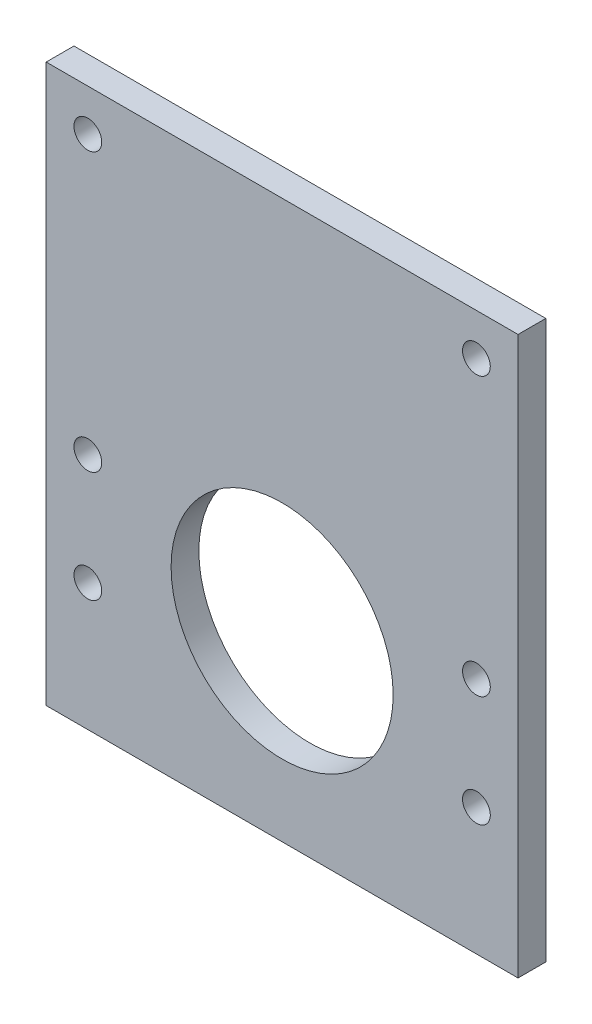
ISO-10303-21;
HEADER;
FILE_DESCRIPTION(('STEP AP214'),'2;1');
FILE_NAME('part.step','',(''),(''),'','','');
FILE_SCHEMA(('AUTOMOTIVE_DESIGN { 1 0 10303 214 1 1 1 1 }'));
ENDSEC;
DATA;
#1=APPLICATION_CONTEXT('core data for automotive mechanical design processes');
#2=APPLICATION_PROTOCOL_DEFINITION('international standard','automotive_design',2000,#1);
#3=PRODUCT_CONTEXT('',#1,'mechanical');
#4=PRODUCT('Part','Part','',(#3));
#5=PRODUCT_RELATED_PRODUCT_CATEGORY('part','',(#4));
#6=PRODUCT_DEFINITION_FORMATION('','',#4);
#7=PRODUCT_DEFINITION_CONTEXT('part definition',#1,'design');
#8=PRODUCT_DEFINITION('design','',#6,#7);
#9=PRODUCT_DEFINITION_SHAPE('','',#8);
#10=(LENGTH_UNIT() NAMED_UNIT(*) SI_UNIT(.MILLI.,.METRE.));
#11=(NAMED_UNIT(*) PLANE_ANGLE_UNIT() SI_UNIT($,.RADIAN.));
#12=(NAMED_UNIT(*) SI_UNIT($,.STERADIAN.) SOLID_ANGLE_UNIT());
#13=UNCERTAINTY_MEASURE_WITH_UNIT(LENGTH_MEASURE(1.E-05),#10,'distance_accuracy_value','');
#14=(GEOMETRIC_REPRESENTATION_CONTEXT(3) GLOBAL_UNCERTAINTY_ASSIGNED_CONTEXT((#13)) GLOBAL_UNIT_ASSIGNED_CONTEXT((#10,
#11,#12)) REPRESENTATION_CONTEXT('',''));
#15=CARTESIAN_POINT('',(0.,0.,0.));
#16=DIRECTION('',(0.,0.,1.));
#17=DIRECTION('',(1.,0.,0.));
#18=AXIS2_PLACEMENT_3D('',#15,#16,#17);
#19=CARTESIAN_POINT('',(0.,0.,6.35));
#20=DIRECTION('',(0.,0.,1.));
#21=DIRECTION('',(1.,0.,0.));
#22=AXIS2_PLACEMENT_3D('',#19,#20,#21);
#23=PLANE('',#22);
#24=CARTESIAN_POINT('',(44.45,-12.7,6.35));
#25=DIRECTION('',(0.,0.,1.));
#26=DIRECTION('',(-1.,0.,0.));
#27=AXIS2_PLACEMENT_3D('',#24,#25,#26);
#28=CIRCLE('',#27,3.175);
#29=CARTESIAN_POINT('',(41.275,-12.7,6.35));
#30=VERTEX_POINT('',#29);
#31=EDGE_CURVE('E140',#30,#30,#28,.T.);
#32=ORIENTED_EDGE('',*,*,#31,.F.);
#33=EDGE_LOOP('',(#32));
#34=FACE_BOUND('',#33,.T.);
#35=CARTESIAN_POINT('',(-44.45,12.7,6.35));
#36=DIRECTION('',(0.,0.,1.));
#37=DIRECTION('',(1.,0.,0.));
#38=AXIS2_PLACEMENT_3D('',#35,#36,#37);
#39=CIRCLE('',#38,3.175);
#40=CARTESIAN_POINT('',(-41.275,12.7,6.35));
#41=VERTEX_POINT('',#40);
#42=EDGE_CURVE('E128',#41,#41,#39,.T.);
#43=ORIENTED_EDGE('',*,*,#42,.F.);
#44=EDGE_LOOP('',(#43));
#45=FACE_BOUND('',#44,.T.);
#46=CARTESIAN_POINT('',(-44.45,76.2,6.35));
#47=DIRECTION('',(0.,0.,1.));
#48=DIRECTION('',(1.,0.,0.));
#49=AXIS2_PLACEMENT_3D('',#46,#47,#48);
#50=CIRCLE('',#49,3.175);
#51=CARTESIAN_POINT('',(-41.275,76.2,6.35));
#52=VERTEX_POINT('',#51);
#53=EDGE_CURVE('E116',#52,#52,#50,.T.);
#54=ORIENTED_EDGE('',*,*,#53,.F.);
#55=EDGE_LOOP('',(#54));
#56=FACE_BOUND('',#55,.T.);
#57=DIRECTION('',(0.,-1.,0.));
#58=VECTOR('',#57,1.);
#59=CARTESIAN_POINT('',(-53.975,85.725,6.35));
#60=LINE('',#59,#58);
#61=CARTESIAN_POINT('',(-53.975,85.725,6.35));
#62=VERTEX_POINT('',#61);
#63=CARTESIAN_POINT('',(-53.975,-41.783,6.35));
#64=VERTEX_POINT('',#63);
#65=EDGE_CURVE('E86',#62,#64,#60,.T.);
#66=ORIENTED_EDGE('',*,*,#65,.T.);
#67=DIRECTION('',(1.,0.,0.));
#68=VECTOR('',#67,1.);
#69=CARTESIAN_POINT('',(-53.975,-41.783,6.35));
#70=LINE('',#69,#68);
#71=CARTESIAN_POINT('',(53.975,-41.783,6.35));
#72=VERTEX_POINT('',#71);
#73=EDGE_CURVE('E81',#64,#72,#70,.T.);
#74=ORIENTED_EDGE('',*,*,#73,.T.);
#75=DIRECTION('',(0.,1.,0.));
#76=VECTOR('',#75,1.);
#77=CARTESIAN_POINT('',(53.975,85.725,6.35));
#78=LINE('',#77,#76);
#79=CARTESIAN_POINT('',(53.975,85.725,6.35));
#80=VERTEX_POINT('',#79);
#81=EDGE_CURVE('E84',#72,#80,#78,.T.);
#82=ORIENTED_EDGE('',*,*,#81,.T.);
#83=DIRECTION('',(-1.,0.,0.));
#84=VECTOR('',#83,1.);
#85=CARTESIAN_POINT('',(-53.975,85.725,6.35));
#86=LINE('',#85,#84);
#87=EDGE_CURVE('E51',#80,#62,#86,.T.);
#88=ORIENTED_EDGE('',*,*,#87,.T.);
#89=EDGE_LOOP('',(#66,#74,#82,#88));
#90=FACE_BOUND('',#89,.T.);
#91=CARTESIAN_POINT('',(0.,0.,6.35));
#92=DIRECTION('',(0.,0.,1.));
#93=DIRECTION('',(1.,0.,0.));
#94=AXIS2_PLACEMENT_3D('',#91,#92,#93);
#95=CIRCLE('',#94,25.4);
#96=CARTESIAN_POINT('',(25.4,0.,6.35));
#97=VERTEX_POINT('',#96);
#98=EDGE_CURVE('E101',#97,#97,#95,.T.);
#99=ORIENTED_EDGE('',*,*,#98,.F.);
#100=EDGE_LOOP('',(#99));
#101=FACE_BOUND('',#100,.T.);
#102=CARTESIAN_POINT('',(44.45,76.2,6.35));
#103=DIRECTION('',(0.,0.,1.));
#104=DIRECTION('',(1.,0.,0.));
#105=AXIS2_PLACEMENT_3D('',#102,#103,#104);
#106=CIRCLE('',#105,3.175);
#107=CARTESIAN_POINT('',(47.625,76.2,6.35));
#108=VERTEX_POINT('',#107);
#109=EDGE_CURVE('E122',#108,#108,#106,.T.);
#110=ORIENTED_EDGE('',*,*,#109,.F.);
#111=EDGE_LOOP('',(#110));
#112=FACE_BOUND('',#111,.T.);
#113=CARTESIAN_POINT('',(-44.45,-12.7,6.35));
#114=DIRECTION('',(0.,0.,1.));
#115=DIRECTION('',(1.,0.,0.));
#116=AXIS2_PLACEMENT_3D('',#113,#114,#115);
#117=CIRCLE('',#116,3.175);
#118=CARTESIAN_POINT('',(-41.275,-12.7,6.35));
#119=VERTEX_POINT('',#118);
#120=EDGE_CURVE('E134',#119,#119,#117,.T.);
#121=ORIENTED_EDGE('',*,*,#120,.F.);
#122=EDGE_LOOP('',(#121));
#123=FACE_BOUND('',#122,.T.);
#124=CARTESIAN_POINT('',(44.45,12.7,6.35));
#125=DIRECTION('',(0.,0.,1.));
#126=DIRECTION('',(-1.,0.,0.));
#127=AXIS2_PLACEMENT_3D('',#124,#125,#126);
#128=CIRCLE('',#127,3.175);
#129=CARTESIAN_POINT('',(41.275,12.7,6.35));
#130=VERTEX_POINT('',#129);
#131=EDGE_CURVE('E146',#130,#130,#128,.T.);
#132=ORIENTED_EDGE('',*,*,#131,.F.);
#133=EDGE_LOOP('',(#132));
#134=FACE_BOUND('',#133,.T.);
#135=ADVANCED_FACE('F34',(#34,#45,#56,#90,#101,#112,#123,#134),#23,.T.);
#136=CARTESIAN_POINT('',(0.,0.,0.));
#137=DIRECTION('',(0.,0.,1.));
#138=DIRECTION('',(1.,0.,0.));
#139=AXIS2_PLACEMENT_3D('',#136,#137,#138);
#140=PLANE('',#139);
#141=DIRECTION('',(0.,-1.,0.));
#142=VECTOR('',#141,1.);
#143=CARTESIAN_POINT('',(-53.975,85.725,0.));
#144=LINE('',#143,#142);
#145=CARTESIAN_POINT('',(-53.975,85.725,0.));
#146=VERTEX_POINT('',#145);
#147=CARTESIAN_POINT('',(-53.975,-41.783,0.));
#148=VERTEX_POINT('',#147);
#149=EDGE_CURVE('E98',#146,#148,#144,.T.);
#150=ORIENTED_EDGE('',*,*,#149,.F.);
#151=DIRECTION('',(-1.,0.,0.));
#152=VECTOR('',#151,1.);
#153=CARTESIAN_POINT('',(-53.975,85.725,0.));
#154=LINE('',#153,#152);
#155=CARTESIAN_POINT('',(53.975,85.725,0.));
#156=VERTEX_POINT('',#155);
#157=EDGE_CURVE('E74',#156,#146,#154,.T.);
#158=ORIENTED_EDGE('',*,*,#157,.F.);
#159=DIRECTION('',(0.,1.,0.));
#160=VECTOR('',#159,1.);
#161=CARTESIAN_POINT('',(53.975,85.725,0.));
#162=LINE('',#161,#160);
#163=CARTESIAN_POINT('',(53.975,-41.783,0.));
#164=VERTEX_POINT('',#163);
#165=EDGE_CURVE('E68',#164,#156,#162,.T.);
#166=ORIENTED_EDGE('',*,*,#165,.F.);
#167=DIRECTION('',(1.,0.,0.));
#168=VECTOR('',#167,1.);
#169=CARTESIAN_POINT('',(-53.975,-41.783,0.));
#170=LINE('',#169,#168);
#171=EDGE_CURVE('E90',#148,#164,#170,.T.);
#172=ORIENTED_EDGE('',*,*,#171,.F.);
#173=EDGE_LOOP('',(#150,#158,#166,#172));
#174=FACE_BOUND('',#173,.T.);
#175=CARTESIAN_POINT('',(0.,0.,0.));
#176=DIRECTION('',(0.,0.,1.));
#177=DIRECTION('',(1.,0.,0.));
#178=AXIS2_PLACEMENT_3D('',#175,#176,#177);
#179=CIRCLE('',#178,25.4);
#180=CARTESIAN_POINT('',(25.4,0.,0.));
#181=VERTEX_POINT('',#180);
#182=EDGE_CURVE('E113',#181,#181,#179,.T.);
#183=ORIENTED_EDGE('',*,*,#182,.T.);
#184=EDGE_LOOP('',(#183));
#185=FACE_BOUND('',#184,.T.);
#186=CARTESIAN_POINT('',(-44.45,76.2,0.));
#187=DIRECTION('',(0.,0.,1.));
#188=DIRECTION('',(1.,0.,0.));
#189=AXIS2_PLACEMENT_3D('',#186,#187,#188);
#190=CIRCLE('',#189,3.175);
#191=CARTESIAN_POINT('',(-41.275,76.2,0.));
#192=VERTEX_POINT('',#191);
#193=EDGE_CURVE('E119',#192,#192,#190,.T.);
#194=ORIENTED_EDGE('',*,*,#193,.T.);
#195=EDGE_LOOP('',(#194));
#196=FACE_BOUND('',#195,.T.);
#197=CARTESIAN_POINT('',(44.45,76.2,0.));
#198=DIRECTION('',(0.,0.,1.));
#199=DIRECTION('',(1.,0.,0.));
#200=AXIS2_PLACEMENT_3D('',#197,#198,#199);
#201=CIRCLE('',#200,3.175);
#202=CARTESIAN_POINT('',(47.625,76.2,0.));
#203=VERTEX_POINT('',#202);
#204=EDGE_CURVE('E125',#203,#203,#201,.T.);
#205=ORIENTED_EDGE('',*,*,#204,.T.);
#206=EDGE_LOOP('',(#205));
#207=FACE_BOUND('',#206,.T.);
#208=CARTESIAN_POINT('',(-44.45,12.7,0.));
#209=DIRECTION('',(0.,0.,1.));
#210=DIRECTION('',(1.,0.,0.));
#211=AXIS2_PLACEMENT_3D('',#208,#209,#210);
#212=CIRCLE('',#211,3.175);
#213=CARTESIAN_POINT('',(-41.275,12.7,0.));
#214=VERTEX_POINT('',#213);
#215=EDGE_CURVE('E131',#214,#214,#212,.T.);
#216=ORIENTED_EDGE('',*,*,#215,.T.);
#217=EDGE_LOOP('',(#216));
#218=FACE_BOUND('',#217,.T.);
#219=CARTESIAN_POINT('',(-44.45,-12.7,0.));
#220=DIRECTION('',(0.,0.,1.));
#221=DIRECTION('',(1.,0.,0.));
#222=AXIS2_PLACEMENT_3D('',#219,#220,#221);
#223=CIRCLE('',#222,3.175);
#224=CARTESIAN_POINT('',(-41.275,-12.7,0.));
#225=VERTEX_POINT('',#224);
#226=EDGE_CURVE('E137',#225,#225,#223,.T.);
#227=ORIENTED_EDGE('',*,*,#226,.T.);
#228=EDGE_LOOP('',(#227));
#229=FACE_BOUND('',#228,.T.);
#230=CARTESIAN_POINT('',(44.45,-12.7,0.));
#231=DIRECTION('',(0.,0.,1.));
#232=DIRECTION('',(-1.,0.,0.));
#233=AXIS2_PLACEMENT_3D('',#230,#231,#232);
#234=CIRCLE('',#233,3.175);
#235=CARTESIAN_POINT('',(41.275,-12.7,0.));
#236=VERTEX_POINT('',#235);
#237=EDGE_CURVE('E143',#236,#236,#234,.T.);
#238=ORIENTED_EDGE('',*,*,#237,.T.);
#239=EDGE_LOOP('',(#238));
#240=FACE_BOUND('',#239,.T.);
#241=CARTESIAN_POINT('',(44.45,12.7,0.));
#242=DIRECTION('',(0.,0.,1.));
#243=DIRECTION('',(-1.,0.,0.));
#244=AXIS2_PLACEMENT_3D('',#241,#242,#243);
#245=CIRCLE('',#244,3.175);
#246=CARTESIAN_POINT('',(41.275,12.7,0.));
#247=VERTEX_POINT('',#246);
#248=EDGE_CURVE('E149',#247,#247,#245,.T.);
#249=ORIENTED_EDGE('',*,*,#248,.T.);
#250=EDGE_LOOP('',(#249));
#251=FACE_BOUND('',#250,.T.);
#252=ADVANCED_FACE('F109',(#174,#185,#196,#207,#218,#229,#240,#251),#140,.F.);
#253=CARTESIAN_POINT('',(-53.975,85.725,6.35));
#254=DIRECTION('',(1.,0.,0.));
#255=DIRECTION('',(0.,1.,0.));
#256=AXIS2_PLACEMENT_3D('',#253,#254,#255);
#257=PLANE('',#256);
#258=ORIENTED_EDGE('',*,*,#149,.T.);
#259=DIRECTION('',(0.,0.,-1.));
#260=VECTOR('',#259,1.);
#261=CARTESIAN_POINT('',(-53.975,-41.783,6.35));
#262=LINE('',#261,#260);
#263=EDGE_CURVE('E11',#64,#148,#262,.T.);
#264=ORIENTED_EDGE('',*,*,#263,.F.);
#265=ORIENTED_EDGE('',*,*,#65,.F.);
#266=DIRECTION('',(0.,0.,-1.));
#267=VECTOR('',#266,1.);
#268=CARTESIAN_POINT('',(-53.975,85.725,6.35));
#269=LINE('',#268,#267);
#270=EDGE_CURVE('E94',#62,#146,#269,.T.);
#271=ORIENTED_EDGE('',*,*,#270,.T.);
#272=EDGE_LOOP('',(#258,#264,#265,#271));
#273=FACE_BOUND('',#272,.T.);
#274=ADVANCED_FACE('F36',(#273),#257,.F.);
#275=CARTESIAN_POINT('',(-53.975,-41.783,6.35));
#276=DIRECTION('',(0.,1.,0.));
#277=DIRECTION('',(0.,0.,1.));
#278=AXIS2_PLACEMENT_3D('',#275,#276,#277);
#279=PLANE('',#278);
#280=ORIENTED_EDGE('',*,*,#171,.T.);
#281=DIRECTION('',(0.,0.,-1.));
#282=VECTOR('',#281,1.);
#283=CARTESIAN_POINT('',(53.975,-41.783,6.35));
#284=LINE('',#283,#282);
#285=EDGE_CURVE('E43',#72,#164,#284,.T.);
#286=ORIENTED_EDGE('',*,*,#285,.F.);
#287=ORIENTED_EDGE('',*,*,#73,.F.);
#288=ORIENTED_EDGE('',*,*,#263,.T.);
#289=EDGE_LOOP('',(#280,#286,#287,#288));
#290=FACE_BOUND('',#289,.T.);
#291=ADVANCED_FACE('F89',(#290),#279,.F.);
#292=CARTESIAN_POINT('',(53.975,85.725,6.35));
#293=DIRECTION('',(-1.,0.,0.));
#294=DIRECTION('',(0.,-1.,0.));
#295=AXIS2_PLACEMENT_3D('',#292,#293,#294);
#296=PLANE('',#295);
#297=ORIENTED_EDGE('',*,*,#165,.T.);
#298=DIRECTION('',(0.,0.,-1.));
#299=VECTOR('',#298,1.);
#300=CARTESIAN_POINT('',(53.975,85.725,6.35));
#301=LINE('',#300,#299);
#302=EDGE_CURVE('E91',#80,#156,#301,.T.);
#303=ORIENTED_EDGE('',*,*,#302,.F.);
#304=ORIENTED_EDGE('',*,*,#81,.F.);
#305=ORIENTED_EDGE('',*,*,#285,.T.);
#306=EDGE_LOOP('',(#297,#303,#304,#305));
#307=FACE_BOUND('',#306,.T.);
#308=ADVANCED_FACE('F92',(#307),#296,.F.);
#309=CARTESIAN_POINT('',(-53.975,85.725,6.35));
#310=DIRECTION('',(0.,-1.,0.));
#311=DIRECTION('',(0.,0.,-1.));
#312=AXIS2_PLACEMENT_3D('',#309,#310,#311);
#313=PLANE('',#312);
#314=ORIENTED_EDGE('',*,*,#157,.T.);
#315=ORIENTED_EDGE('',*,*,#270,.F.);
#316=ORIENTED_EDGE('',*,*,#87,.F.);
#317=ORIENTED_EDGE('',*,*,#302,.T.);
#318=EDGE_LOOP('',(#314,#315,#316,#317));
#319=FACE_BOUND('',#318,.T.);
#320=ADVANCED_FACE('F106',(#319),#313,.F.);
#321=CARTESIAN_POINT('',(0.,0.,6.35));
#322=DIRECTION('',(0.,0.,-1.));
#323=DIRECTION('',(-1.,0.,0.));
#324=AXIS2_PLACEMENT_3D('',#321,#322,#323);
#325=CYLINDRICAL_SURFACE('',#324,25.4);
#326=ORIENTED_EDGE('',*,*,#98,.T.);
#327=EDGE_LOOP('',(#326));
#328=FACE_BOUND('',#327,.T.);
#329=ORIENTED_EDGE('',*,*,#182,.F.);
#330=EDGE_LOOP('',(#329));
#331=FACE_BOUND('',#330,.T.);
#332=ADVANCED_FACE('F168',(#328,#331),#325,.F.);
#333=CARTESIAN_POINT('',(-44.45,76.2,6.35));
#334=DIRECTION('',(0.,0.,-1.));
#335=DIRECTION('',(-1.,0.,0.));
#336=AXIS2_PLACEMENT_3D('',#333,#334,#335);
#337=CYLINDRICAL_SURFACE('',#336,3.175);
#338=ORIENTED_EDGE('',*,*,#53,.T.);
#339=EDGE_LOOP('',(#338));
#340=FACE_BOUND('',#339,.T.);
#341=ORIENTED_EDGE('',*,*,#193,.F.);
#342=EDGE_LOOP('',(#341));
#343=FACE_BOUND('',#342,.T.);
#344=ADVANCED_FACE('F214',(#340,#343),#337,.F.);
#345=CARTESIAN_POINT('',(44.45,76.2,6.35));
#346=DIRECTION('',(0.,0.,-1.));
#347=DIRECTION('',(-1.,0.,0.));
#348=AXIS2_PLACEMENT_3D('',#345,#346,#347);
#349=CYLINDRICAL_SURFACE('',#348,3.175);
#350=ORIENTED_EDGE('',*,*,#109,.T.);
#351=EDGE_LOOP('',(#350));
#352=FACE_BOUND('',#351,.T.);
#353=ORIENTED_EDGE('',*,*,#204,.F.);
#354=EDGE_LOOP('',(#353));
#355=FACE_BOUND('',#354,.T.);
#356=ADVANCED_FACE('F222',(#352,#355),#349,.F.);
#357=CARTESIAN_POINT('',(-44.45,12.7,6.35));
#358=DIRECTION('',(0.,0.,-1.));
#359=DIRECTION('',(-1.,0.,0.));
#360=AXIS2_PLACEMENT_3D('',#357,#358,#359);
#361=CYLINDRICAL_SURFACE('',#360,3.175);
#362=ORIENTED_EDGE('',*,*,#42,.T.);
#363=EDGE_LOOP('',(#362));
#364=FACE_BOUND('',#363,.T.);
#365=ORIENTED_EDGE('',*,*,#215,.F.);
#366=EDGE_LOOP('',(#365));
#367=FACE_BOUND('',#366,.T.);
#368=ADVANCED_FACE('F230',(#364,#367),#361,.F.);
#369=CARTESIAN_POINT('',(-44.45,-12.7,6.35));
#370=DIRECTION('',(0.,0.,-1.));
#371=DIRECTION('',(-1.,0.,0.));
#372=AXIS2_PLACEMENT_3D('',#369,#370,#371);
#373=CYLINDRICAL_SURFACE('',#372,3.175);
#374=ORIENTED_EDGE('',*,*,#120,.T.);
#375=EDGE_LOOP('',(#374));
#376=FACE_BOUND('',#375,.T.);
#377=ORIENTED_EDGE('',*,*,#226,.F.);
#378=EDGE_LOOP('',(#377));
#379=FACE_BOUND('',#378,.T.);
#380=ADVANCED_FACE('F239',(#376,#379),#373,.F.);
#381=CARTESIAN_POINT('',(44.45,-12.7,6.35));
#382=DIRECTION('',(0.,0.,-1.));
#383=DIRECTION('',(-1.,0.,0.));
#384=AXIS2_PLACEMENT_3D('',#381,#382,#383);
#385=CYLINDRICAL_SURFACE('',#384,3.175);
#386=ORIENTED_EDGE('',*,*,#31,.T.);
#387=EDGE_LOOP('',(#386));
#388=FACE_BOUND('',#387,.T.);
#389=ORIENTED_EDGE('',*,*,#237,.F.);
#390=EDGE_LOOP('',(#389));
#391=FACE_BOUND('',#390,.T.);
#392=ADVANCED_FACE('F248',(#388,#391),#385,.F.);
#393=CARTESIAN_POINT('',(44.45,12.7,6.35));
#394=DIRECTION('',(0.,0.,-1.));
#395=DIRECTION('',(-1.,0.,0.));
#396=AXIS2_PLACEMENT_3D('',#393,#394,#395);
#397=CYLINDRICAL_SURFACE('',#396,3.175);
#398=ORIENTED_EDGE('',*,*,#131,.T.);
#399=EDGE_LOOP('',(#398));
#400=FACE_BOUND('',#399,.T.);
#401=ORIENTED_EDGE('',*,*,#248,.F.);
#402=EDGE_LOOP('',(#401));
#403=FACE_BOUND('',#402,.T.);
#404=ADVANCED_FACE('F155',(#400,#403),#397,.F.);
#405=CLOSED_SHELL('',(#135,#252,#274,#291,#308,#320,#332,#344,#356,#368,#380,#392,#404));
#406=MANIFOLD_SOLID_BREP('B2',#405);
#407=ADVANCED_BREP_SHAPE_REPRESENTATION('',(#18,#406),#14);
#408=SHAPE_DEFINITION_REPRESENTATION(#9,#407);
ENDSEC;
END-ISO-10303-21;
